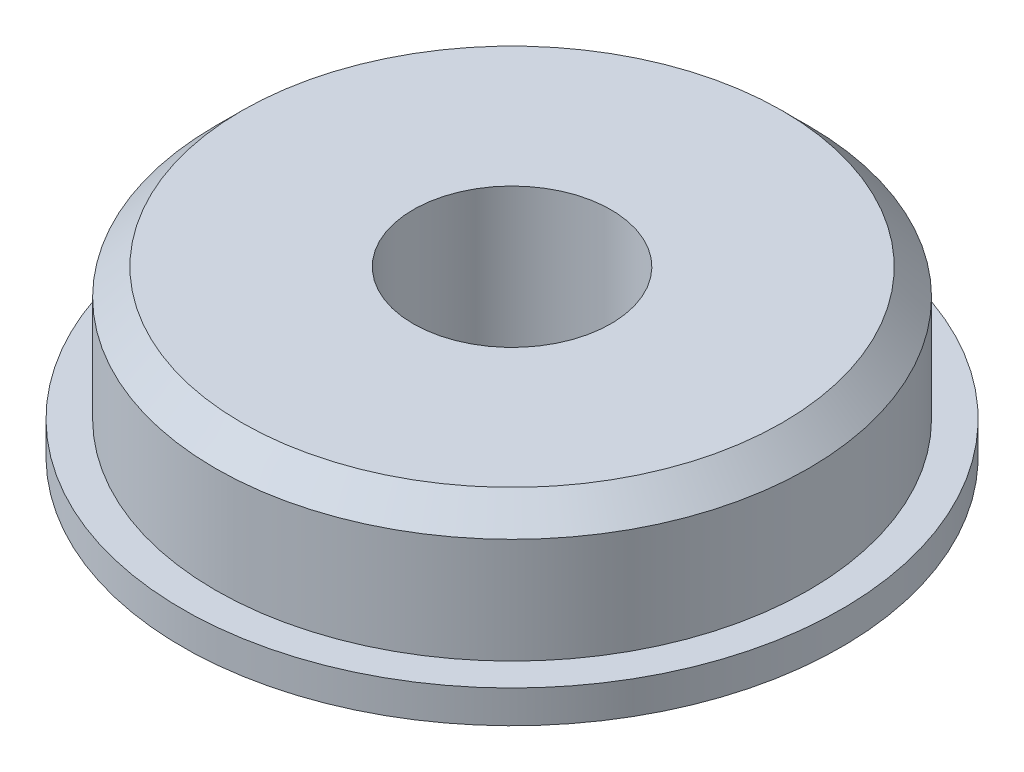
ISO-10303-21;
HEADER;
FILE_DESCRIPTION(('STEP AP214'),'2;1');
FILE_NAME('part.step','',(''),(''),'','','');
FILE_SCHEMA(('AUTOMOTIVE_DESIGN { 1 0 10303 214 1 1 1 1 }'));
ENDSEC;
DATA;
#1=APPLICATION_CONTEXT('core data for automotive mechanical design processes');
#2=APPLICATION_PROTOCOL_DEFINITION('international standard','automotive_design',2000,#1);
#3=PRODUCT_CONTEXT('',#1,'mechanical');
#4=PRODUCT('Part','Part','',(#3));
#5=PRODUCT_RELATED_PRODUCT_CATEGORY('part','',(#4));
#6=PRODUCT_DEFINITION_FORMATION('','',#4);
#7=PRODUCT_DEFINITION_CONTEXT('part definition',#1,'design');
#8=PRODUCT_DEFINITION('design','',#6,#7);
#9=PRODUCT_DEFINITION_SHAPE('','',#8);
#10=(LENGTH_UNIT() NAMED_UNIT(*) SI_UNIT(.MILLI.,.METRE.));
#11=(NAMED_UNIT(*) PLANE_ANGLE_UNIT() SI_UNIT($,.RADIAN.));
#12=(NAMED_UNIT(*) SI_UNIT($,.STERADIAN.) SOLID_ANGLE_UNIT());
#13=UNCERTAINTY_MEASURE_WITH_UNIT(LENGTH_MEASURE(1.E-05),#10,'distance_accuracy_value','');
#14=(GEOMETRIC_REPRESENTATION_CONTEXT(3) GLOBAL_UNCERTAINTY_ASSIGNED_CONTEXT((#13)) GLOBAL_UNIT_ASSIGNED_CONTEXT((#10,
#11,#12)) REPRESENTATION_CONTEXT('',''));
#15=CARTESIAN_POINT('',(0.,0.,0.));
#16=DIRECTION('',(0.,0.,1.));
#17=DIRECTION('',(1.,0.,0.));
#18=AXIS2_PLACEMENT_3D('',#15,#16,#17);
#19=CARTESIAN_POINT('',(0.,7.9248,0.));
#20=DIRECTION('',(0.,-1.,0.));
#21=DIRECTION('',(0.,0.,-1.));
#22=AXIS2_PLACEMENT_3D('',#19,#20,#21);
#23=CYLINDRICAL_SURFACE('',#22,14.2875);
#24=CARTESIAN_POINT('',(0.,6.6548,0.));
#25=DIRECTION('',(0.,1.,0.));
#26=DIRECTION('',(0.,0.,1.));
#27=AXIS2_PLACEMENT_3D('',#24,#25,#26);
#28=CIRCLE('',#27,14.2875);
#29=CARTESIAN_POINT('',(0.,6.6548,14.2875));
#30=VERTEX_POINT('',#29);
#31=EDGE_CURVE('E10',#30,#30,#28,.F.);
#32=ORIENTED_EDGE('',*,*,#31,.T.);
#33=EDGE_LOOP('',(#32));
#34=FACE_BOUND('',#33,.T.);
#35=CARTESIAN_POINT('',(0.,1.5748,0.));
#36=DIRECTION('',(0.,-1.,0.));
#37=DIRECTION('',(0.,0.,-1.));
#38=AXIS2_PLACEMENT_3D('',#35,#36,#37);
#39=CIRCLE('',#38,14.2875);
#40=CARTESIAN_POINT('',(0.,1.5748,-14.2875));
#41=VERTEX_POINT('',#40);
#42=EDGE_CURVE('E46',#41,#41,#39,.T.);
#43=ORIENTED_EDGE('',*,*,#42,.F.);
#44=EDGE_LOOP('',(#43));
#45=FACE_BOUND('',#44,.T.);
#46=ADVANCED_FACE('F35',(#34,#45),#23,.T.);
#47=CARTESIAN_POINT('',(0.,7.9248,0.));
#48=DIRECTION('',(0.,1.,0.));
#49=DIRECTION('',(0.,0.,1.));
#50=AXIS2_PLACEMENT_3D('',#47,#48,#49);
#51=PLANE('',#50);
#52=CARTESIAN_POINT('',(0.,7.9248,0.));
#53=DIRECTION('',(0.,1.,0.));
#54=DIRECTION('',(0.,0.,1.));
#55=AXIS2_PLACEMENT_3D('',#52,#53,#54);
#56=CIRCLE('',#55,13.0175);
#57=CARTESIAN_POINT('',(0.,7.9248,13.0175));
#58=VERTEX_POINT('',#57);
#59=EDGE_CURVE('E42',#58,#58,#56,.T.);
#60=ORIENTED_EDGE('',*,*,#59,.T.);
#61=EDGE_LOOP('',(#60));
#62=FACE_BOUND('',#61,.T.);
#63=CARTESIAN_POINT('',(0.,7.9248,0.));
#64=DIRECTION('',(0.,1.,0.));
#65=DIRECTION('',(0.,0.,1.));
#66=AXIS2_PLACEMENT_3D('',#63,#64,#65);
#67=CIRCLE('',#66,4.7625);
#68=CARTESIAN_POINT('',(0.,7.9248,4.7625));
#69=VERTEX_POINT('',#68);
#70=EDGE_CURVE('E50',#69,#69,#67,.T.);
#71=ORIENTED_EDGE('',*,*,#70,.F.);
#72=EDGE_LOOP('',(#71));
#73=FACE_BOUND('',#72,.T.);
#74=ADVANCED_FACE('F80',(#62,#73),#51,.T.);
#75=CARTESIAN_POINT('',(0.,0.,0.));
#76=DIRECTION('',(0.,1.,0.));
#77=DIRECTION('',(0.,0.,1.));
#78=AXIS2_PLACEMENT_3D('',#75,#76,#77);
#79=PLANE('',#78);
#80=CARTESIAN_POINT('',(0.,0.,0.));
#81=DIRECTION('',(0.,1.,0.));
#82=DIRECTION('',(0.,0.,1.));
#83=AXIS2_PLACEMENT_3D('',#80,#81,#82);
#84=CIRCLE('',#83,4.7625);
#85=CARTESIAN_POINT('',(0.,0.,4.7625));
#86=VERTEX_POINT('',#85);
#87=EDGE_CURVE('E53',#86,#86,#84,.T.);
#88=ORIENTED_EDGE('',*,*,#87,.T.);
#89=EDGE_LOOP('',(#88));
#90=FACE_BOUND('',#89,.T.);
#91=CARTESIAN_POINT('',(0.,0.,0.));
#92=DIRECTION('',(0.,-1.,0.));
#93=DIRECTION('',(0.,0.,-1.));
#94=AXIS2_PLACEMENT_3D('',#91,#92,#93);
#95=CIRCLE('',#94,15.875);
#96=CARTESIAN_POINT('',(0.,0.,-15.875));
#97=VERTEX_POINT('',#96);
#98=EDGE_CURVE('E59',#97,#97,#95,.T.);
#99=ORIENTED_EDGE('',*,*,#98,.T.);
#100=EDGE_LOOP('',(#99));
#101=FACE_BOUND('',#100,.T.);
#102=ADVANCED_FACE('F84',(#90,#101),#79,.F.);
#103=CARTESIAN_POINT('',(0.,7.9248,0.));
#104=DIRECTION('',(0.,-1.,0.));
#105=DIRECTION('',(0.,0.,-1.));
#106=AXIS2_PLACEMENT_3D('',#103,#104,#105);
#107=CYLINDRICAL_SURFACE('',#106,4.7625);
#108=ORIENTED_EDGE('',*,*,#70,.T.);
#109=EDGE_LOOP('',(#108));
#110=FACE_BOUND('',#109,.T.);
#111=ORIENTED_EDGE('',*,*,#87,.F.);
#112=EDGE_LOOP('',(#111));
#113=FACE_BOUND('',#112,.T.);
#114=ADVANCED_FACE('F77',(#110,#113),#107,.F.);
#115=CARTESIAN_POINT('',(0.,1.5748,0.));
#116=DIRECTION('',(0.,-1.,0.));
#117=DIRECTION('',(0.,0.,-1.));
#118=AXIS2_PLACEMENT_3D('',#115,#116,#117);
#119=CYLINDRICAL_SURFACE('',#118,15.875);
#120=CARTESIAN_POINT('',(0.,1.5748,0.));
#121=DIRECTION('',(0.,-1.,0.));
#122=DIRECTION('',(0.,0.,-1.));
#123=AXIS2_PLACEMENT_3D('',#120,#121,#122);
#124=CIRCLE('',#123,15.875);
#125=CARTESIAN_POINT('',(0.,1.5748,-15.875));
#126=VERTEX_POINT('',#125);
#127=EDGE_CURVE('E56',#126,#126,#124,.T.);
#128=ORIENTED_EDGE('',*,*,#127,.T.);
#129=EDGE_LOOP('',(#128));
#130=FACE_BOUND('',#129,.T.);
#131=ORIENTED_EDGE('',*,*,#98,.F.);
#132=EDGE_LOOP('',(#131));
#133=FACE_BOUND('',#132,.T.);
#134=ADVANCED_FACE('F65',(#130,#133),#119,.T.);
#135=CARTESIAN_POINT('',(0.,1.5748,0.));
#136=DIRECTION('',(0.,-1.,0.));
#137=DIRECTION('',(0.,0.,-1.));
#138=AXIS2_PLACEMENT_3D('',#135,#136,#137);
#139=PLANE('',#138);
#140=ORIENTED_EDGE('',*,*,#42,.T.);
#141=EDGE_LOOP('',(#140));
#142=FACE_BOUND('',#141,.T.);
#143=ORIENTED_EDGE('',*,*,#127,.F.);
#144=EDGE_LOOP('',(#143));
#145=FACE_BOUND('',#144,.T.);
#146=ADVANCED_FACE('F68',(#142,#145),#139,.F.);
#147=CARTESIAN_POINT('',(0.,7.9248,0.));
#148=DIRECTION('',(0.,-1.,0.));
#149=DIRECTION('',(0.,0.,-1.));
#150=AXIS2_PLACEMENT_3D('',#147,#148,#149);
#151=CONICAL_SURFACE('',#150,13.0175,0.785398163397446);
#152=ORIENTED_EDGE('',*,*,#31,.F.);
#153=EDGE_LOOP('',(#152));
#154=FACE_BOUND('',#153,.T.);
#155=ORIENTED_EDGE('',*,*,#59,.F.);
#156=EDGE_LOOP('',(#155));
#157=FACE_BOUND('',#156,.T.);
#158=ADVANCED_FACE('F37',(#154,#157),#151,.T.);
#159=CLOSED_SHELL('',(#46,#74,#102,#114,#134,#146,#158));
#160=MANIFOLD_SOLID_BREP('B2',#159);
#161=ADVANCED_BREP_SHAPE_REPRESENTATION('',(#18,#160),#14);
#162=SHAPE_DEFINITION_REPRESENTATION(#9,#161);
ENDSEC;
END-ISO-10303-21;
